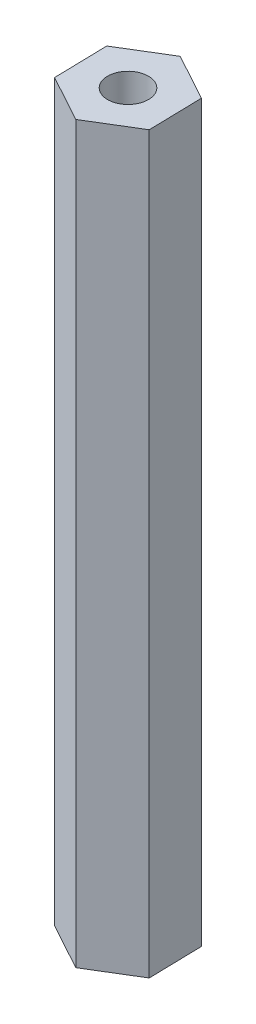
ISO-10303-21;
HEADER;
FILE_DESCRIPTION(('STEP AP214'),'2;1');
FILE_NAME('part.step','',(''),(''),'','','');
FILE_SCHEMA(('AUTOMOTIVE_DESIGN { 1 0 10303 214 1 1 1 1 }'));
ENDSEC;
DATA;
#1=APPLICATION_CONTEXT('core data for automotive mechanical design processes');
#2=APPLICATION_PROTOCOL_DEFINITION('international standard','automotive_design',2000,#1);
#3=PRODUCT_CONTEXT('',#1,'mechanical');
#4=PRODUCT('Part','Part','',(#3));
#5=PRODUCT_RELATED_PRODUCT_CATEGORY('part','',(#4));
#6=PRODUCT_DEFINITION_FORMATION('','',#4);
#7=PRODUCT_DEFINITION_CONTEXT('part definition',#1,'design');
#8=PRODUCT_DEFINITION('design','',#6,#7);
#9=PRODUCT_DEFINITION_SHAPE('','',#8);
#10=(LENGTH_UNIT() NAMED_UNIT(*) SI_UNIT(.MILLI.,.METRE.));
#11=(NAMED_UNIT(*) PLANE_ANGLE_UNIT() SI_UNIT($,.RADIAN.));
#12=(NAMED_UNIT(*) SI_UNIT($,.STERADIAN.) SOLID_ANGLE_UNIT());
#13=UNCERTAINTY_MEASURE_WITH_UNIT(LENGTH_MEASURE(1.E-05),#10,'distance_accuracy_value','');
#14=(GEOMETRIC_REPRESENTATION_CONTEXT(3) GLOBAL_UNCERTAINTY_ASSIGNED_CONTEXT((#13)) GLOBAL_UNIT_ASSIGNED_CONTEXT((#10,
#11,#12)) REPRESENTATION_CONTEXT('',''));
#15=CARTESIAN_POINT('',(0.,0.,0.));
#16=DIRECTION('',(0.,0.,1.));
#17=DIRECTION('',(1.,0.,0.));
#18=AXIS2_PLACEMENT_3D('',#15,#16,#17);
#19=CARTESIAN_POINT('',(3.2423851288328,50.8,1.77304414956987));
#20=DIRECTION('',(-0.999731122485951,0.,0.0231879868246597));
#21=DIRECTION('',(0.0231879868246597,0.,0.999731122485951));
#22=AXIS2_PLACEMENT_3D('',#19,#20,#21);
#23=PLANE('',#22);
#24=DIRECTION('',(-0.0231879868246597,0.,-0.999731122485951));
#25=VECTOR('',#24,1.);
#26=CARTESIAN_POINT('',(3.2423851288328,0.,1.77304414956987));
#27=LINE('',#26,#25);
#28=CARTESIAN_POINT('',(3.2423851288328,0.,1.77304414956987));
#29=VERTEX_POINT('',#28);
#30=CARTESIAN_POINT('',(3.15669383997528,0.,-1.92146581563715));
#31=VERTEX_POINT('',#30);
#32=EDGE_CURVE('E119',#29,#31,#27,.T.);
#33=ORIENTED_EDGE('',*,*,#32,.T.);
#34=DIRECTION('',(0.,-1.,0.));
#35=VECTOR('',#34,1.);
#36=CARTESIAN_POINT('',(3.15669383997528,50.8,-1.92146581563715));
#37=LINE('',#36,#35);
#38=CARTESIAN_POINT('',(3.15669383997528,50.8,-1.92146581563715));
#39=VERTEX_POINT('',#38);
#40=EDGE_CURVE('E11',#39,#31,#37,.T.);
#41=ORIENTED_EDGE('',*,*,#40,.F.);
#42=DIRECTION('',(-0.0231879868246597,0.,-0.999731122485951));
#43=VECTOR('',#42,1.);
#44=CARTESIAN_POINT('',(3.2423851288328,50.8,1.77304414956987));
#45=LINE('',#44,#43);
#46=CARTESIAN_POINT('',(3.2423851288328,50.8,1.77304414956987));
#47=VERTEX_POINT('',#46);
#48=EDGE_CURVE('E130',#47,#39,#45,.T.);
#49=ORIENTED_EDGE('',*,*,#48,.F.);
#50=DIRECTION('',(0.,-1.,0.));
#51=VECTOR('',#50,1.);
#52=CARTESIAN_POINT('',(3.2423851288328,50.8,1.77304414956987));
#53=LINE('',#52,#51);
#54=EDGE_CURVE('E115',#47,#29,#53,.T.);
#55=ORIENTED_EDGE('',*,*,#54,.T.);
#56=EDGE_LOOP('',(#33,#41,#49,#55));
#57=FACE_BOUND('',#56,.T.);
#58=ADVANCED_FACE('F35',(#57),#23,.F.);
#59=CARTESIAN_POINT('',(3.15669383997528,50.8,-1.92146581563715));
#60=DIRECTION('',(-0.479784175590201,0.,0.877386542439095));
#61=DIRECTION('',(0.877386542439096,0.,0.479784175590202));
#62=AXIS2_PLACEMENT_3D('',#59,#60,#61);
#63=PLANE('',#62);
#64=DIRECTION('',(-0.877386542439096,0.,-0.479784175590201));
#65=VECTOR('',#64,1.);
#66=CARTESIAN_POINT('',(3.15669383997528,0.,-1.92146581563715));
#67=LINE('',#66,#65);
#68=CARTESIAN_POINT('',(-0.0856912888575173,0.,-3.69450996520702));
#69=VERTEX_POINT('',#68);
#70=EDGE_CURVE('E122',#31,#69,#67,.T.);
#71=ORIENTED_EDGE('',*,*,#70,.T.);
#72=DIRECTION('',(0.,-1.,0.));
#73=VECTOR('',#72,1.);
#74=CARTESIAN_POINT('',(-0.0856912888575173,50.8,-3.69450996520702));
#75=LINE('',#74,#73);
#76=CARTESIAN_POINT('',(-0.0856912888575173,50.8,-3.69450996520702));
#77=VERTEX_POINT('',#76);
#78=EDGE_CURVE('E43',#77,#69,#75,.T.);
#79=ORIENTED_EDGE('',*,*,#78,.F.);
#80=DIRECTION('',(-0.877386542439096,0.,-0.479784175590201));
#81=VECTOR('',#80,1.);
#82=CARTESIAN_POINT('',(3.15669383997528,50.8,-1.92146581563715));
#83=LINE('',#82,#81);
#84=EDGE_CURVE('E88',#39,#77,#83,.T.);
#85=ORIENTED_EDGE('',*,*,#84,.F.);
#86=ORIENTED_EDGE('',*,*,#40,.T.);
#87=EDGE_LOOP('',(#71,#79,#85,#86));
#88=FACE_BOUND('',#87,.T.);
#89=ADVANCED_FACE('F155',(#88),#63,.F.);
#90=CARTESIAN_POINT('',(-0.0856912888575173,50.8,-3.69450996520702));
#91=DIRECTION('',(0.51994694689575,0.,0.854198555614436));
#92=DIRECTION('',(0.854198555614436,0.,-0.51994694689575));
#93=AXIS2_PLACEMENT_3D('',#90,#91,#92);
#94=PLANE('',#93);
#95=DIRECTION('',(-0.854198555614436,0.,0.51994694689575));
#96=VECTOR('',#95,1.);
#97=CARTESIAN_POINT('',(-0.0856912888575173,0.,-3.69450996520702));
#98=LINE('',#97,#96);
#99=CARTESIAN_POINT('',(-3.2423851288328,0.,-1.77304414956987));
#100=VERTEX_POINT('',#99);
#101=EDGE_CURVE('E125',#69,#100,#98,.T.);
#102=ORIENTED_EDGE('',*,*,#101,.T.);
#103=DIRECTION('',(0.,-1.,0.));
#104=VECTOR('',#103,1.);
#105=CARTESIAN_POINT('',(-3.2423851288328,50.8,-1.77304414956987));
#106=LINE('',#105,#104);
#107=CARTESIAN_POINT('',(-3.2423851288328,50.8,-1.77304414956987));
#108=VERTEX_POINT('',#107);
#109=EDGE_CURVE('E110',#108,#100,#106,.T.);
#110=ORIENTED_EDGE('',*,*,#109,.F.);
#111=DIRECTION('',(-0.854198555614436,0.,0.51994694689575));
#112=VECTOR('',#111,1.);
#113=CARTESIAN_POINT('',(-0.0856912888575173,50.8,-3.69450996520702));
#114=LINE('',#113,#112);
#115=EDGE_CURVE('E101',#77,#108,#114,.T.);
#116=ORIENTED_EDGE('',*,*,#115,.F.);
#117=ORIENTED_EDGE('',*,*,#78,.T.);
#118=EDGE_LOOP('',(#102,#110,#116,#117));
#119=FACE_BOUND('',#118,.T.);
#120=ADVANCED_FACE('F136',(#119),#94,.F.);
#121=CARTESIAN_POINT('',(-3.2423851288328,50.8,-1.77304414956987));
#122=DIRECTION('',(0.999731122485951,0.,-0.0231879868246599));
#123=DIRECTION('',(-0.0231879868246599,0.,-0.999731122485951));
#124=AXIS2_PLACEMENT_3D('',#121,#122,#123);
#125=PLANE('',#124);
#126=DIRECTION('',(0.0231879868246599,0.,0.999731122485951));
#127=VECTOR('',#126,1.);
#128=CARTESIAN_POINT('',(-3.2423851288328,0.,-1.77304414956987));
#129=LINE('',#128,#127);
#130=CARTESIAN_POINT('',(-3.15669383997528,0.,1.92146581563715));
#131=VERTEX_POINT('',#130);
#132=EDGE_CURVE('E109',#100,#131,#129,.T.);
#133=ORIENTED_EDGE('',*,*,#132,.T.);
#134=DIRECTION('',(0.,-1.,0.));
#135=VECTOR('',#134,1.);
#136=CARTESIAN_POINT('',(-3.15669383997528,50.8,1.92146581563715));
#137=LINE('',#136,#135);
#138=CARTESIAN_POINT('',(-3.15669383997528,50.8,1.92146581563715));
#139=VERTEX_POINT('',#138);
#140=EDGE_CURVE('E106',#139,#131,#137,.T.);
#141=ORIENTED_EDGE('',*,*,#140,.F.);
#142=DIRECTION('',(0.0231879868246599,0.,0.999731122485951));
#143=VECTOR('',#142,1.);
#144=CARTESIAN_POINT('',(-3.2423851288328,50.8,-1.77304414956987));
#145=LINE('',#144,#143);
#146=EDGE_CURVE('E95',#108,#139,#145,.T.);
#147=ORIENTED_EDGE('',*,*,#146,.F.);
#148=ORIENTED_EDGE('',*,*,#109,.T.);
#149=EDGE_LOOP('',(#133,#141,#147,#148));
#150=FACE_BOUND('',#149,.T.);
#151=ADVANCED_FACE('F107',(#150),#125,.F.);
#152=CARTESIAN_POINT('',(-3.15669383997528,50.8,1.92146581563715));
#153=DIRECTION('',(0.479784175590201,0.,-0.877386542439096));
#154=DIRECTION('',(-0.877386542439096,0.,-0.479784175590201));
#155=AXIS2_PLACEMENT_3D('',#152,#153,#154);
#156=PLANE('',#155);
#157=DIRECTION('',(0.877386542439096,0.,0.479784175590201));
#158=VECTOR('',#157,1.);
#159=CARTESIAN_POINT('',(-3.15669383997528,0.,1.92146581563715));
#160=LINE('',#159,#158);
#161=CARTESIAN_POINT('',(0.0856912888575184,0.,3.69450996520702));
#162=VERTEX_POINT('',#161);
#163=EDGE_CURVE('E74',#131,#162,#160,.T.);
#164=ORIENTED_EDGE('',*,*,#163,.T.);
#165=DIRECTION('',(0.,-1.,0.));
#166=VECTOR('',#165,1.);
#167=CARTESIAN_POINT('',(0.0856912888575184,50.8,3.69450996520702));
#168=LINE('',#167,#166);
#169=CARTESIAN_POINT('',(0.0856912888575184,50.8,3.69450996520702));
#170=VERTEX_POINT('',#169);
#171=EDGE_CURVE('E111',#170,#162,#168,.T.);
#172=ORIENTED_EDGE('',*,*,#171,.F.);
#173=DIRECTION('',(0.877386542439096,0.,0.479784175590201));
#174=VECTOR('',#173,1.);
#175=CARTESIAN_POINT('',(-3.15669383997528,50.8,1.92146581563715));
#176=LINE('',#175,#174);
#177=EDGE_CURVE('E99',#139,#170,#176,.T.);
#178=ORIENTED_EDGE('',*,*,#177,.F.);
#179=ORIENTED_EDGE('',*,*,#140,.T.);
#180=EDGE_LOOP('',(#164,#172,#178,#179));
#181=FACE_BOUND('',#180,.T.);
#182=ADVANCED_FACE('F113',(#181),#156,.F.);
#183=CARTESIAN_POINT('',(0.0856912888575184,50.8,3.69450996520702));
#184=DIRECTION('',(-0.51994694689575,0.,-0.854198555614436));
#185=DIRECTION('',(-0.854198555614436,0.,0.51994694689575));
#186=AXIS2_PLACEMENT_3D('',#183,#184,#185);
#187=PLANE('',#186);
#188=DIRECTION('',(0.854198555614436,0.,-0.51994694689575));
#189=VECTOR('',#188,1.);
#190=CARTESIAN_POINT('',(0.0856912888575184,0.,3.69450996520702));
#191=LINE('',#190,#189);
#192=EDGE_CURVE('E80',#162,#29,#191,.T.);
#193=ORIENTED_EDGE('',*,*,#192,.T.);
#194=ORIENTED_EDGE('',*,*,#54,.F.);
#195=DIRECTION('',(0.854198555614436,0.,-0.51994694689575));
#196=VECTOR('',#195,1.);
#197=CARTESIAN_POINT('',(0.0856912888575184,50.8,3.69450996520702));
#198=LINE('',#197,#196);
#199=EDGE_CURVE('E51',#170,#47,#198,.T.);
#200=ORIENTED_EDGE('',*,*,#199,.F.);
#201=ORIENTED_EDGE('',*,*,#171,.T.);
#202=EDGE_LOOP('',(#193,#194,#200,#201));
#203=FACE_BOUND('',#202,.T.);
#204=ADVANCED_FACE('F143',(#203),#187,.F.);
#205=CARTESIAN_POINT('',(0.,50.8,0.));
#206=DIRECTION('',(0.,1.,0.));
#207=DIRECTION('',(0.,0.,1.));
#208=AXIS2_PLACEMENT_3D('',#205,#206,#207);
#209=PLANE('',#208);
#210=CARTESIAN_POINT('',(0.,50.8,0.));
#211=DIRECTION('',(0.,-1.,0.));
#212=DIRECTION('',(0.,0.,-1.));
#213=AXIS2_PLACEMENT_3D('',#210,#211,#212);
#214=CIRCLE('',#213,1.40969999999999);
#215=CARTESIAN_POINT('',(0.,50.8,-1.40969999999999));
#216=VERTEX_POINT('',#215);
#217=EDGE_CURVE('E123',#216,#216,#214,.T.);
#218=ORIENTED_EDGE('',*,*,#217,.T.);
#219=EDGE_LOOP('',(#218));
#220=FACE_BOUND('',#219,.T.);
#221=ORIENTED_EDGE('',*,*,#48,.T.);
#222=ORIENTED_EDGE('',*,*,#84,.T.);
#223=ORIENTED_EDGE('',*,*,#115,.T.);
#224=ORIENTED_EDGE('',*,*,#146,.T.);
#225=ORIENTED_EDGE('',*,*,#177,.T.);
#226=ORIENTED_EDGE('',*,*,#199,.T.);
#227=EDGE_LOOP('',(#221,#222,#223,#224,#225,#226));
#228=FACE_BOUND('',#227,.T.);
#229=ADVANCED_FACE('F97',(#220,#228),#209,.T.);
#230=CARTESIAN_POINT('',(0.,0.,0.));
#231=DIRECTION('',(0.,1.,0.));
#232=DIRECTION('',(0.,0.,1.));
#233=AXIS2_PLACEMENT_3D('',#230,#231,#232);
#234=PLANE('',#233);
#235=CARTESIAN_POINT('',(0.,0.,0.));
#236=DIRECTION('',(0.,-1.,0.));
#237=DIRECTION('',(0.,0.,-1.));
#238=AXIS2_PLACEMENT_3D('',#235,#236,#237);
#239=CIRCLE('',#238,1.40969999999999);
#240=CARTESIAN_POINT('',(0.,0.,-1.40969999999999));
#241=VERTEX_POINT('',#240);
#242=EDGE_CURVE('E210',#241,#241,#239,.T.);
#243=ORIENTED_EDGE('',*,*,#242,.F.);
#244=EDGE_LOOP('',(#243));
#245=FACE_BOUND('',#244,.T.);
#246=ORIENTED_EDGE('',*,*,#32,.F.);
#247=ORIENTED_EDGE('',*,*,#192,.F.);
#248=ORIENTED_EDGE('',*,*,#163,.F.);
#249=ORIENTED_EDGE('',*,*,#132,.F.);
#250=ORIENTED_EDGE('',*,*,#101,.F.);
#251=ORIENTED_EDGE('',*,*,#70,.F.);
#252=EDGE_LOOP('',(#246,#247,#248,#249,#250,#251));
#253=FACE_BOUND('',#252,.T.);
#254=ADVANCED_FACE('F139',(#245,#253),#234,.F.);
#255=CARTESIAN_POINT('',(0.,0.,0.));
#256=DIRECTION('',(0.,-1.,0.));
#257=DIRECTION('',(0.,0.,-1.));
#258=AXIS2_PLACEMENT_3D('',#255,#256,#257);
#259=CYLINDRICAL_SURFACE('',#258,1.40969999999999);
#260=ORIENTED_EDGE('',*,*,#217,.F.);
#261=EDGE_LOOP('',(#260));
#262=FACE_BOUND('',#261,.T.);
#263=ORIENTED_EDGE('',*,*,#242,.T.);
#264=EDGE_LOOP('',(#263));
#265=FACE_BOUND('',#264,.T.);
#266=ADVANCED_FACE('F192',(#262,#265),#259,.F.);
#267=CLOSED_SHELL('',(#58,#89,#120,#151,#182,#204,#229,#254,#266));
#268=MANIFOLD_SOLID_BREP('B2',#267);
#269=ADVANCED_BREP_SHAPE_REPRESENTATION('',(#18,#268),#14);
#270=SHAPE_DEFINITION_REPRESENTATION(#9,#269);
ENDSEC;
END-ISO-10303-21;
